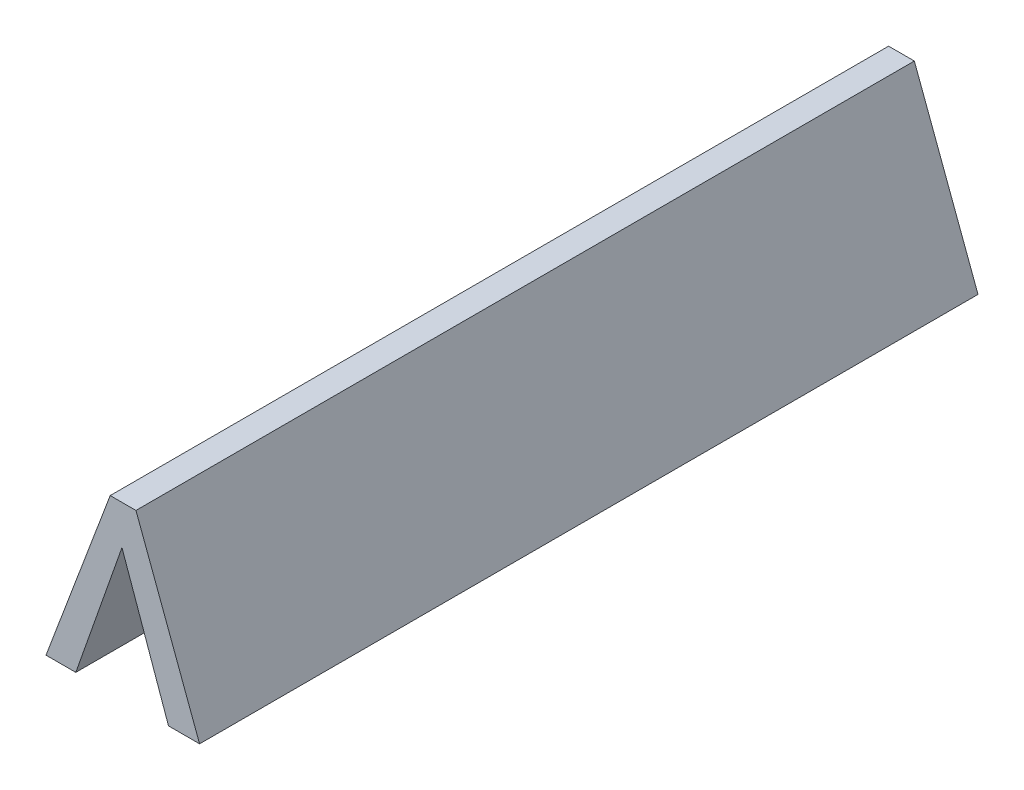
ISO-10303-21;
HEADER;
FILE_DESCRIPTION(('STEP AP214'),'2;1');
FILE_NAME('part.step','',(''),(''),'','','');
FILE_SCHEMA(('AUTOMOTIVE_DESIGN { 1 0 10303 214 1 1 1 1 }'));
ENDSEC;
DATA;
#1=APPLICATION_CONTEXT('core data for automotive mechanical design processes');
#2=APPLICATION_PROTOCOL_DEFINITION('international standard','automotive_design',2000,#1);
#3=PRODUCT_CONTEXT('',#1,'mechanical');
#4=PRODUCT('Part','Part','',(#3));
#5=PRODUCT_RELATED_PRODUCT_CATEGORY('part','',(#4));
#6=PRODUCT_DEFINITION_FORMATION('','',#4);
#7=PRODUCT_DEFINITION_CONTEXT('part definition',#1,'design');
#8=PRODUCT_DEFINITION('design','',#6,#7);
#9=PRODUCT_DEFINITION_SHAPE('','',#8);
#10=(LENGTH_UNIT() NAMED_UNIT(*) SI_UNIT(.MILLI.,.METRE.));
#11=(NAMED_UNIT(*) PLANE_ANGLE_UNIT() SI_UNIT($,.RADIAN.));
#12=(NAMED_UNIT(*) SI_UNIT($,.STERADIAN.) SOLID_ANGLE_UNIT());
#13=UNCERTAINTY_MEASURE_WITH_UNIT(LENGTH_MEASURE(1.E-05),#10,'distance_accuracy_value','');
#14=(GEOMETRIC_REPRESENTATION_CONTEXT(3) GLOBAL_UNCERTAINTY_ASSIGNED_CONTEXT((#13)) GLOBAL_UNIT_ASSIGNED_CONTEXT((#10,
#11,#12)) REPRESENTATION_CONTEXT('',''));
#15=CARTESIAN_POINT('',(0.,0.,0.));
#16=DIRECTION('',(0.,0.,1.));
#17=DIRECTION('',(1.,0.,0.));
#18=AXIS2_PLACEMENT_3D('',#15,#16,#17);
#19=CARTESIAN_POINT('',(5.026226332552,3.55349573247,0.));
#20=DIRECTION('',(0.943258685640876,-0.332058807988956,0.));
#21=DIRECTION('',(0.332058807988956,0.943258685640876,0.));
#22=AXIS2_PLACEMENT_3D('',#19,#20,#21);
#23=PLANE('',#22);
#24=DIRECTION('',(0.332058808010654,0.943258685633238,0.));
#25=VECTOR('',#24,1.);
#26=CARTESIAN_POINT('',(5.026226332552,3.55349573247,0.1));
#27=LINE('',#26,#25);
#28=CARTESIAN_POINT('',(5.026226332552,3.55349573247,0.1));
#29=VERTEX_POINT('',#28);
#30=CARTESIAN_POINT('',(5.03215758117281,3.57034425942807,0.1));
#31=VERTEX_POINT('',#30);
#32=EDGE_CURVE('E112',#29,#31,#27,.T.);
#33=ORIENTED_EDGE('',*,*,#32,.F.);
#34=DIRECTION('',(0.,0.,-1.));
#35=VECTOR('',#34,1.);
#36=CARTESIAN_POINT('',(5.026226332552,3.55349573247,0.));
#37=LINE('',#36,#35);
#38=CARTESIAN_POINT('',(5.026226332552,3.55349573247,0.));
#39=VERTEX_POINT('',#38);
#40=EDGE_CURVE('E81',#39,#29,#37,.F.);
#41=ORIENTED_EDGE('',*,*,#40,.F.);
#42=DIRECTION('',(0.332058808010654,0.943258685633238,0.));
#43=VECTOR('',#42,1.);
#44=CARTESIAN_POINT('',(5.026226332552,3.55349573247,0.));
#45=LINE('',#44,#43);
#46=CARTESIAN_POINT('',(5.03215758117281,3.57034425942807,0.));
#47=VERTEX_POINT('',#46);
#48=EDGE_CURVE('E78',#39,#47,#45,.T.);
#49=ORIENTED_EDGE('',*,*,#48,.T.);
#50=DIRECTION('',(0.,0.,1.));
#51=VECTOR('',#50,1.);
#52=CARTESIAN_POINT('',(5.032157581173,3.570344259428,0.));
#53=LINE('',#52,#51);
#54=EDGE_CURVE('E20',#31,#47,#53,.F.);
#55=ORIENTED_EDGE('',*,*,#54,.F.);
#56=EDGE_LOOP('',(#33,#41,#49,#55));
#57=FACE_BOUND('',#56,.T.);
#58=ADVANCED_FACE('F17',(#57),#23,.T.);
#59=CARTESIAN_POINT('',(5.032157581173,3.570344259428,0.));
#60=DIRECTION('',(-0.942427745481145,-0.334409845171051,0.));
#61=DIRECTION('',(0.334409845171051,-0.942427745481145,0.));
#62=AXIS2_PLACEMENT_3D('',#59,#60,#61);
#63=PLANE('',#62);
#64=DIRECTION('',(0.334409845183585,-0.942427745476697,0.));
#65=VECTOR('',#64,1.);
#66=CARTESIAN_POINT('',(5.032157581173,3.570344259428,0.1));
#67=LINE('',#66,#65);
#68=CARTESIAN_POINT('',(5.03813609073889,3.55349573246996,0.1));
#69=VERTEX_POINT('',#68);
#70=EDGE_CURVE('E88',#31,#69,#67,.T.);
#71=ORIENTED_EDGE('',*,*,#70,.F.);
#72=ORIENTED_EDGE('',*,*,#54,.T.);
#73=DIRECTION('',(0.334409845183585,-0.942427745476697,0.));
#74=VECTOR('',#73,1.);
#75=CARTESIAN_POINT('',(5.032157581173,3.570344259428,0.));
#76=LINE('',#75,#74);
#77=CARTESIAN_POINT('',(5.03813609073889,3.55349573246996,0.));
#78=VERTEX_POINT('',#77);
#79=EDGE_CURVE('E73',#47,#78,#76,.T.);
#80=ORIENTED_EDGE('',*,*,#79,.T.);
#81=DIRECTION('',(0.,0.,-1.));
#82=VECTOR('',#81,1.);
#83=CARTESIAN_POINT('',(5.038136090739,3.55349573247,0.));
#84=LINE('',#83,#82);
#85=EDGE_CURVE('E90',#69,#78,#84,.T.);
#86=ORIENTED_EDGE('',*,*,#85,.F.);
#87=EDGE_LOOP('',(#71,#72,#80,#86));
#88=FACE_BOUND('',#87,.T.);
#89=ADVANCED_FACE('F86',(#88),#63,.T.);
#90=CARTESIAN_POINT('',(5.038136090739,3.55349573247,0.));
#91=DIRECTION('',(0.,-1.,0.));
#92=DIRECTION('',(0.,0.,-1.));
#93=AXIS2_PLACEMENT_3D('',#90,#91,#92);
#94=PLANE('',#93);
#95=DIRECTION('',(1.,0.,0.));
#96=VECTOR('',#95,1.);
#97=CARTESIAN_POINT('',(5.032247424364,3.55349573247,0.1));
#98=LINE('',#97,#96);
#99=CARTESIAN_POINT('',(5.042129640606,3.55349573247,0.1));
#100=VERTEX_POINT('',#99);
#101=EDGE_CURVE('E106',#69,#100,#98,.T.);
#102=ORIENTED_EDGE('',*,*,#101,.F.);
#103=ORIENTED_EDGE('',*,*,#85,.T.);
#104=DIRECTION('',(1.,0.,0.));
#105=VECTOR('',#104,1.);
#106=CARTESIAN_POINT('',(5.032247424364,3.55349573247,0.));
#107=LINE('',#106,#105);
#108=CARTESIAN_POINT('',(5.042129640606,3.55349573247,0.));
#109=VERTEX_POINT('',#108);
#110=EDGE_CURVE('E95',#78,#109,#107,.T.);
#111=ORIENTED_EDGE('',*,*,#110,.T.);
#112=DIRECTION('',(0.,0.,1.));
#113=VECTOR('',#112,1.);
#114=CARTESIAN_POINT('',(5.042129640606,3.55349573247,0.));
#115=LINE('',#114,#113);
#116=EDGE_CURVE('E84',#100,#109,#115,.F.);
#117=ORIENTED_EDGE('',*,*,#116,.F.);
#118=EDGE_LOOP('',(#102,#103,#111,#117));
#119=FACE_BOUND('',#118,.T.);
#120=ADVANCED_FACE('F104',(#119),#94,.T.);
#121=CARTESIAN_POINT('',(5.042129640606,3.55349573247,0.));
#122=DIRECTION('',(0.936744248481783,0.350014589604919,0.));
#123=DIRECTION('',(-0.350014589604919,0.936744248481783,0.));
#124=AXIS2_PLACEMENT_3D('',#121,#122,#123);
#125=PLANE('',#124);
#126=DIRECTION('',(-0.350014589576905,0.93674424849225,0.));
#127=VECTOR('',#126,1.);
#128=CARTESIAN_POINT('',(5.042129640606,3.55349573247,0.1));
#129=LINE('',#128,#127);
#130=CARTESIAN_POINT('',(5.03395349708984,3.57537755008994,0.1));
#131=VERTEX_POINT('',#130);
#132=EDGE_CURVE('E108',#100,#131,#129,.T.);
#133=ORIENTED_EDGE('',*,*,#132,.F.);
#134=ORIENTED_EDGE('',*,*,#116,.T.);
#135=DIRECTION('',(-0.350014589576905,0.93674424849225,0.));
#136=VECTOR('',#135,1.);
#137=CARTESIAN_POINT('',(5.042129640606,3.55349573247,0.));
#138=LINE('',#137,#136);
#139=CARTESIAN_POINT('',(5.03395349708984,3.57537755008994,0.));
#140=VERTEX_POINT('',#139);
#141=EDGE_CURVE('E97',#109,#140,#138,.T.);
#142=ORIENTED_EDGE('',*,*,#141,.T.);
#143=DIRECTION('',(0.,0.,1.));
#144=VECTOR('',#143,1.);
#145=CARTESIAN_POINT('',(5.03395349709,3.57537755009,0.));
#146=LINE('',#145,#144);
#147=EDGE_CURVE('E125',#131,#140,#146,.F.);
#148=ORIENTED_EDGE('',*,*,#147,.F.);
#149=EDGE_LOOP('',(#133,#134,#142,#148));
#150=FACE_BOUND('',#149,.T.);
#151=ADVANCED_FACE('F123',(#150),#125,.T.);
#152=CARTESIAN_POINT('',(5.032247424364,3.562948337698,0.));
#153=DIRECTION('',(0.,0.,1.));
#154=DIRECTION('',(1.,0.,0.));
#155=AXIS2_PLACEMENT_3D('',#152,#153,#154);
#156=PLANE('',#155);
#157=DIRECTION('',(1.,0.,0.));
#158=VECTOR('',#157,1.);
#159=CARTESIAN_POINT('',(5.03395349709,3.57537755009,0.));
#160=LINE('',#159,#158);
#161=CARTESIAN_POINT('',(5.030645230927,3.57537755009,0.));
#162=VERTEX_POINT('',#161);
#163=EDGE_CURVE('E127',#140,#162,#160,.F.);
#164=ORIENTED_EDGE('',*,*,#163,.F.);
#165=ORIENTED_EDGE('',*,*,#141,.F.);
#166=ORIENTED_EDGE('',*,*,#110,.F.);
#167=ORIENTED_EDGE('',*,*,#79,.F.);
#168=ORIENTED_EDGE('',*,*,#48,.F.);
#169=DIRECTION('',(1.,0.,0.));
#170=VECTOR('',#169,1.);
#171=CARTESIAN_POINT('',(5.022398195993,3.55349573247,0.));
#172=LINE('',#171,#170);
#173=CARTESIAN_POINT('',(5.02239819599288,3.55349573247004,0.));
#174=VERTEX_POINT('',#173);
#175=EDGE_CURVE('E120',#174,#39,#172,.T.);
#176=ORIENTED_EDGE('',*,*,#175,.F.);
#177=DIRECTION('',(-0.352673355335192,-0.935746495818508,0.));
#178=VECTOR('',#177,1.);
#179=CARTESIAN_POINT('',(5.030645230927,3.57537755009,0.));
#180=LINE('',#179,#178);
#181=EDGE_CURVE('E129',#162,#174,#180,.T.);
#182=ORIENTED_EDGE('',*,*,#181,.F.);
#183=EDGE_LOOP('',(#164,#165,#166,#167,#168,#176,#182));
#184=FACE_BOUND('',#183,.T.);
#185=ADVANCED_FACE('F93',(#184),#156,.F.);
#186=CARTESIAN_POINT('',(5.022398195993,3.55349573247,0.));
#187=DIRECTION('',(0.,-1.,0.));
#188=DIRECTION('',(0.,0.,-1.));
#189=AXIS2_PLACEMENT_3D('',#186,#187,#188);
#190=PLANE('',#189);
#191=DIRECTION('',(1.,0.,0.));
#192=VECTOR('',#191,1.);
#193=CARTESIAN_POINT('',(5.032247424364,3.55349573247,0.1));
#194=LINE('',#193,#192);
#195=CARTESIAN_POINT('',(5.02239819599288,3.55349573247004,0.1));
#196=VERTEX_POINT('',#195);
#197=EDGE_CURVE('E114',#196,#29,#194,.T.);
#198=ORIENTED_EDGE('',*,*,#197,.F.);
#199=DIRECTION('',(0.,0.,1.));
#200=VECTOR('',#199,1.);
#201=CARTESIAN_POINT('',(5.02239819599254,3.55349573247018,0.));
#202=LINE('',#201,#200);
#203=EDGE_CURVE('E134',#174,#196,#202,.T.);
#204=ORIENTED_EDGE('',*,*,#203,.F.);
#205=ORIENTED_EDGE('',*,*,#175,.T.);
#206=ORIENTED_EDGE('',*,*,#40,.T.);
#207=EDGE_LOOP('',(#198,#204,#205,#206));
#208=FACE_BOUND('',#207,.T.);
#209=ADVANCED_FACE('F145',(#208),#190,.T.);
#210=CARTESIAN_POINT('',(5.032247424364,3.562948337698,0.1));
#211=DIRECTION('',(0.,0.,1.));
#212=DIRECTION('',(1.,0.,0.));
#213=AXIS2_PLACEMENT_3D('',#210,#211,#212);
#214=PLANE('',#213);
#215=ORIENTED_EDGE('',*,*,#132,.T.);
#216=DIRECTION('',(1.,0.,0.));
#217=VECTOR('',#216,1.);
#218=CARTESIAN_POINT('',(5.03395349709,3.57537755009,0.1));
#219=LINE('',#218,#217);
#220=CARTESIAN_POINT('',(5.030645230927,3.57537755009,0.1));
#221=VERTEX_POINT('',#220);
#222=EDGE_CURVE('E35',#221,#131,#219,.T.);
#223=ORIENTED_EDGE('',*,*,#222,.F.);
#224=DIRECTION('',(-0.352673355335192,-0.935746495818508,0.));
#225=VECTOR('',#224,1.);
#226=CARTESIAN_POINT('',(5.030645230927,3.57537755009,0.1));
#227=LINE('',#226,#225);
#228=EDGE_CURVE('E26',#196,#221,#227,.F.);
#229=ORIENTED_EDGE('',*,*,#228,.F.);
#230=ORIENTED_EDGE('',*,*,#197,.T.);
#231=ORIENTED_EDGE('',*,*,#32,.T.);
#232=ORIENTED_EDGE('',*,*,#70,.T.);
#233=ORIENTED_EDGE('',*,*,#101,.T.);
#234=EDGE_LOOP('',(#215,#223,#229,#230,#231,#232,#233));
#235=FACE_BOUND('',#234,.T.);
#236=ADVANCED_FACE('F110',(#235),#214,.T.);
#237=CARTESIAN_POINT('',(5.03395349709,3.57537755009,0.));
#238=DIRECTION('',(0.,1.,0.));
#239=DIRECTION('',(0.,0.,1.));
#240=AXIS2_PLACEMENT_3D('',#237,#238,#239);
#241=PLANE('',#240);
#242=ORIENTED_EDGE('',*,*,#222,.T.);
#243=ORIENTED_EDGE('',*,*,#147,.T.);
#244=ORIENTED_EDGE('',*,*,#163,.T.);
#245=DIRECTION('',(0.,0.,1.));
#246=VECTOR('',#245,1.);
#247=CARTESIAN_POINT('',(5.030645230927,3.57537755009,0.));
#248=LINE('',#247,#246);
#249=EDGE_CURVE('E11',#221,#162,#248,.F.);
#250=ORIENTED_EDGE('',*,*,#249,.F.);
#251=EDGE_LOOP('',(#242,#243,#244,#250));
#252=FACE_BOUND('',#251,.T.);
#253=ADVANCED_FACE('F132',(#252),#241,.T.);
#254=CARTESIAN_POINT('',(5.030645230927,3.57537755009,0.));
#255=DIRECTION('',(-0.935746495818508,0.352673355335192,0.));
#256=DIRECTION('',(-0.352673355335192,-0.935746495818508,0.));
#257=AXIS2_PLACEMENT_3D('',#254,#255,#256);
#258=PLANE('',#257);
#259=ORIENTED_EDGE('',*,*,#228,.T.);
#260=ORIENTED_EDGE('',*,*,#249,.T.);
#261=ORIENTED_EDGE('',*,*,#181,.T.);
#262=ORIENTED_EDGE('',*,*,#203,.T.);
#263=EDGE_LOOP('',(#259,#260,#261,#262));
#264=FACE_BOUND('',#263,.T.);
#265=ADVANCED_FACE('F142',(#264),#258,.T.);
#266=CLOSED_SHELL('',(#58,#89,#120,#151,#185,#209,#236,#253,#265));
#267=MANIFOLD_SOLID_BREP('B1',#266);
#268=ADVANCED_BREP_SHAPE_REPRESENTATION('',(#18,#267),#14);
#269=SHAPE_DEFINITION_REPRESENTATION(#9,#268);
ENDSEC;
END-ISO-10303-21;
